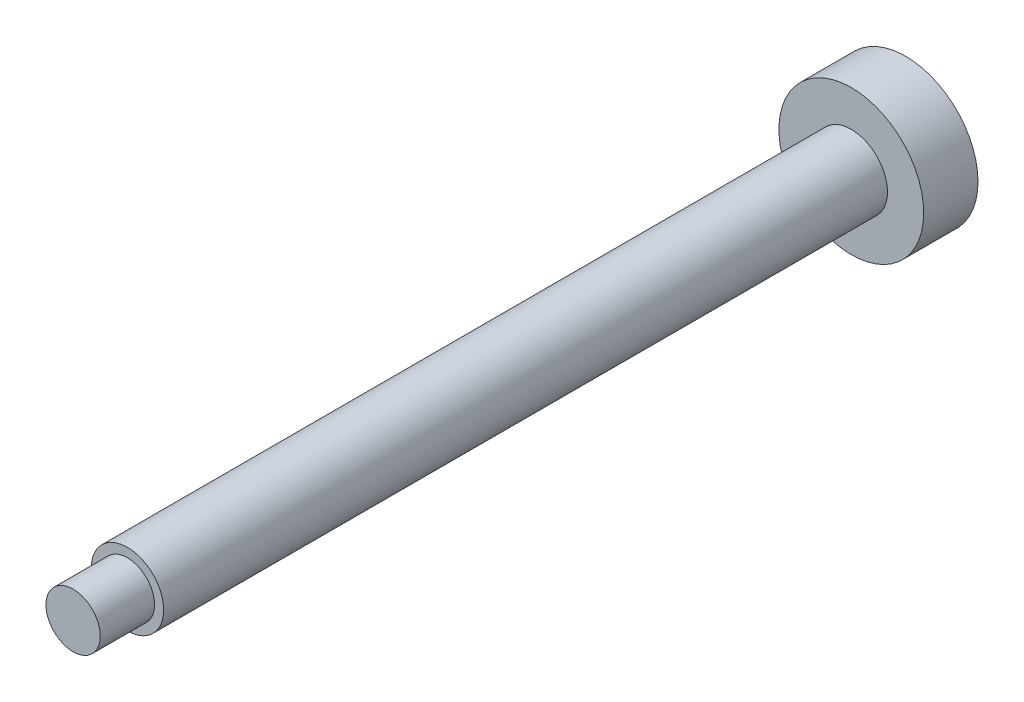
ISO-10303-21;
HEADER;
FILE_DESCRIPTION(('STEP AP214'),'2;1');
FILE_NAME('part.step','',(''),(''),'','','');
FILE_SCHEMA(('AUTOMOTIVE_DESIGN { 1 0 10303 214 1 1 1 1 }'));
ENDSEC;
DATA;
#1=APPLICATION_CONTEXT('core data for automotive mechanical design processes');
#2=APPLICATION_PROTOCOL_DEFINITION('international standard','automotive_design',2000,#1);
#3=PRODUCT_CONTEXT('',#1,'mechanical');
#4=PRODUCT('Part','Part','',(#3));
#5=PRODUCT_RELATED_PRODUCT_CATEGORY('part','',(#4));
#6=PRODUCT_DEFINITION_FORMATION('','',#4);
#7=PRODUCT_DEFINITION_CONTEXT('part definition',#1,'design');
#8=PRODUCT_DEFINITION('design','',#6,#7);
#9=PRODUCT_DEFINITION_SHAPE('','',#8);
#10=(LENGTH_UNIT() NAMED_UNIT(*) SI_UNIT(.MILLI.,.METRE.));
#11=(NAMED_UNIT(*) PLANE_ANGLE_UNIT() SI_UNIT($,.RADIAN.));
#12=(NAMED_UNIT(*) SI_UNIT($,.STERADIAN.) SOLID_ANGLE_UNIT());
#13=UNCERTAINTY_MEASURE_WITH_UNIT(LENGTH_MEASURE(1.E-05),#10,'distance_accuracy_value','');
#14=(GEOMETRIC_REPRESENTATION_CONTEXT(3) GLOBAL_UNCERTAINTY_ASSIGNED_CONTEXT((#13)) GLOBAL_UNIT_ASSIGNED_CONTEXT((#10,
#11,#12)) REPRESENTATION_CONTEXT('',''));
#15=CARTESIAN_POINT('',(0.,0.,0.));
#16=DIRECTION('',(0.,0.,1.));
#17=DIRECTION('',(1.,0.,0.));
#18=AXIS2_PLACEMENT_3D('',#15,#16,#17);
#19=CARTESIAN_POINT('',(0.,0.,40.));
#20=DIRECTION('',(0.,0.,-1.));
#21=DIRECTION('',(-1.,0.,0.));
#22=AXIS2_PLACEMENT_3D('',#19,#20,#21);
#23=CYLINDRICAL_SURFACE('',#22,2.);
#24=CARTESIAN_POINT('',(0.,0.,40.));
#25=DIRECTION('',(0.,0.,1.));
#26=DIRECTION('',(1.,0.,0.));
#27=AXIS2_PLACEMENT_3D('',#24,#25,#26);
#28=CIRCLE('',#27,2.);
#29=CARTESIAN_POINT('',(2.,0.,40.));
#30=VERTEX_POINT('',#29);
#31=EDGE_CURVE('E10',#30,#30,#28,.T.);
#32=ORIENTED_EDGE('',*,*,#31,.F.);
#33=EDGE_LOOP('',(#32));
#34=FACE_BOUND('',#33,.T.);
#35=CARTESIAN_POINT('',(0.,0.,0.));
#36=DIRECTION('',(0.,0.,1.));
#37=DIRECTION('',(1.,0.,0.));
#38=AXIS2_PLACEMENT_3D('',#35,#36,#37);
#39=CIRCLE('',#38,2.);
#40=CARTESIAN_POINT('',(2.,0.,0.));
#41=VERTEX_POINT('',#40);
#42=EDGE_CURVE('E40',#41,#41,#39,.T.);
#43=ORIENTED_EDGE('',*,*,#42,.T.);
#44=EDGE_LOOP('',(#43));
#45=FACE_BOUND('',#44,.T.);
#46=ADVANCED_FACE('F37',(#34,#45),#23,.T.);
#47=CARTESIAN_POINT('',(0.,0.,40.));
#48=DIRECTION('',(0.,0.,1.));
#49=DIRECTION('',(1.,0.,0.));
#50=AXIS2_PLACEMENT_3D('',#47,#48,#49);
#51=PLANE('',#50);
#52=CARTESIAN_POINT('',(0.,0.,40.));
#53=DIRECTION('',(0.,0.,1.));
#54=DIRECTION('',(1.,0.,0.));
#55=AXIS2_PLACEMENT_3D('',#52,#53,#54);
#56=CIRCLE('',#55,1.5);
#57=CARTESIAN_POINT('',(1.5,0.,40.));
#58=VERTEX_POINT('',#57);
#59=EDGE_CURVE('E45',#58,#58,#56,.F.);
#60=ORIENTED_EDGE('',*,*,#59,.T.);
#61=EDGE_LOOP('',(#60));
#62=FACE_BOUND('',#61,.T.);
#63=ORIENTED_EDGE('',*,*,#31,.T.);
#64=EDGE_LOOP('',(#63));
#65=FACE_BOUND('',#64,.T.);
#66=ADVANCED_FACE('F91',(#62,#65),#51,.T.);
#67=CARTESIAN_POINT('',(0.,0.,43.));
#68=DIRECTION('',(0.,0.,-1.));
#69=DIRECTION('',(-1.,0.,0.));
#70=AXIS2_PLACEMENT_3D('',#67,#68,#69);
#71=CYLINDRICAL_SURFACE('',#70,1.5);
#72=ORIENTED_EDGE('',*,*,#59,.F.);
#73=EDGE_LOOP('',(#72));
#74=FACE_BOUND('',#73,.T.);
#75=CARTESIAN_POINT('',(0.,0.,43.));
#76=DIRECTION('',(0.,0.,1.));
#77=DIRECTION('',(1.,0.,0.));
#78=AXIS2_PLACEMENT_3D('',#75,#76,#77);
#79=CIRCLE('',#78,1.5);
#80=CARTESIAN_POINT('',(1.5,0.,43.));
#81=VERTEX_POINT('',#80);
#82=EDGE_CURVE('E50',#81,#81,#79,.T.);
#83=ORIENTED_EDGE('',*,*,#82,.F.);
#84=EDGE_LOOP('',(#83));
#85=FACE_BOUND('',#84,.T.);
#86=ADVANCED_FACE('F87',(#74,#85),#71,.T.);
#87=CARTESIAN_POINT('',(0.,0.,43.));
#88=DIRECTION('',(0.,0.,1.));
#89=DIRECTION('',(1.,0.,0.));
#90=AXIS2_PLACEMENT_3D('',#87,#88,#89);
#91=PLANE('',#90);
#92=ORIENTED_EDGE('',*,*,#82,.T.);
#93=EDGE_LOOP('',(#92));
#94=FACE_BOUND('',#93,.T.);
#95=ADVANCED_FACE('F79',(#94),#91,.T.);
#96=CARTESIAN_POINT('',(0.,0.,-3.));
#97=DIRECTION('',(0.,0.,1.));
#98=DIRECTION('',(1.,0.,0.));
#99=AXIS2_PLACEMENT_3D('',#96,#97,#98);
#100=CYLINDRICAL_SURFACE('',#99,4.);
#101=CARTESIAN_POINT('',(0.,0.,-3.));
#102=DIRECTION('',(0.,0.,1.));
#103=DIRECTION('',(1.,0.,0.));
#104=AXIS2_PLACEMENT_3D('',#101,#102,#103);
#105=CIRCLE('',#104,4.);
#106=CARTESIAN_POINT('',(4.,0.,-3.));
#107=VERTEX_POINT('',#106);
#108=EDGE_CURVE('E60',#107,#107,#105,.T.);
#109=ORIENTED_EDGE('',*,*,#108,.T.);
#110=EDGE_LOOP('',(#109));
#111=FACE_BOUND('',#110,.T.);
#112=CARTESIAN_POINT('',(0.,0.,0.));
#113=DIRECTION('',(0.,0.,1.));
#114=DIRECTION('',(1.,0.,0.));
#115=AXIS2_PLACEMENT_3D('',#112,#113,#114);
#116=CIRCLE('',#115,4.);
#117=CARTESIAN_POINT('',(4.,0.,0.));
#118=VERTEX_POINT('',#117);
#119=EDGE_CURVE('E56',#118,#118,#116,.T.);
#120=ORIENTED_EDGE('',*,*,#119,.F.);
#121=EDGE_LOOP('',(#120));
#122=FACE_BOUND('',#121,.T.);
#123=ADVANCED_FACE('F77',(#111,#122),#100,.T.);
#124=CARTESIAN_POINT('',(0.,0.,-3.));
#125=DIRECTION('',(0.,0.,1.));
#126=DIRECTION('',(1.,0.,0.));
#127=AXIS2_PLACEMENT_3D('',#124,#125,#126);
#128=PLANE('',#127);
#129=ORIENTED_EDGE('',*,*,#108,.F.);
#130=EDGE_LOOP('',(#129));
#131=FACE_BOUND('',#130,.T.);
#132=ADVANCED_FACE('F73',(#131),#128,.F.);
#133=CARTESIAN_POINT('',(0.,0.,0.));
#134=DIRECTION('',(0.,0.,1.));
#135=DIRECTION('',(1.,0.,0.));
#136=AXIS2_PLACEMENT_3D('',#133,#134,#135);
#137=PLANE('',#136);
#138=ORIENTED_EDGE('',*,*,#42,.F.);
#139=EDGE_LOOP('',(#138));
#140=FACE_BOUND('',#139,.T.);
#141=ORIENTED_EDGE('',*,*,#119,.T.);
#142=EDGE_LOOP('',(#141));
#143=FACE_BOUND('',#142,.T.);
#144=ADVANCED_FACE('F70',(#140,#143),#137,.T.);
#145=CLOSED_SHELL('',(#46,#66,#86,#95,#123,#132,#144));
#146=MANIFOLD_SOLID_BREP('B2',#145);
#147=ADVANCED_BREP_SHAPE_REPRESENTATION('',(#18,#146),#14);
#148=SHAPE_DEFINITION_REPRESENTATION(#9,#147);
ENDSEC;
END-ISO-10303-21;
